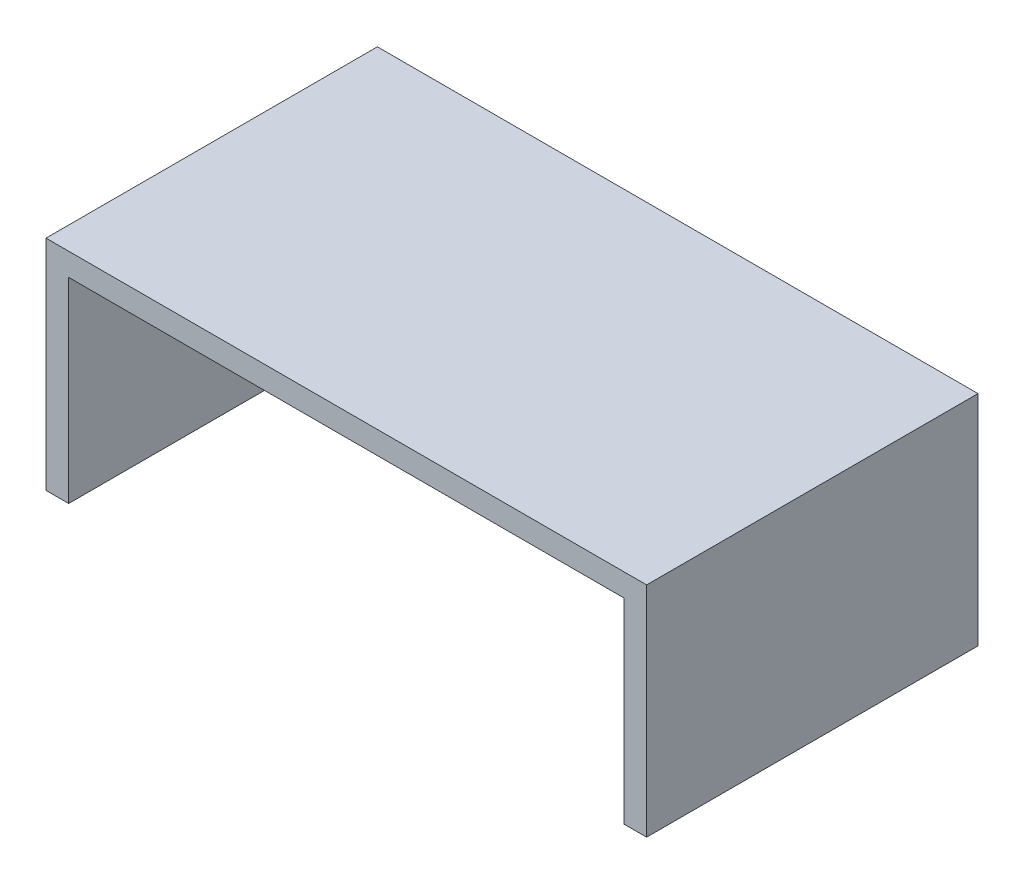
ISO-10303-21;
HEADER;
FILE_DESCRIPTION(('STEP AP214'),'2;1');
FILE_NAME('part.step','',(''),(''),'','','');
FILE_SCHEMA(('AUTOMOTIVE_DESIGN { 1 0 10303 214 1 1 1 1 }'));
ENDSEC;
DATA;
#1=APPLICATION_CONTEXT('core data for automotive mechanical design processes');
#2=APPLICATION_PROTOCOL_DEFINITION('international standard','automotive_design',2000,#1);
#3=PRODUCT_CONTEXT('',#1,'mechanical');
#4=PRODUCT('Part','Part','',(#3));
#5=PRODUCT_RELATED_PRODUCT_CATEGORY('part','',(#4));
#6=PRODUCT_DEFINITION_FORMATION('','',#4);
#7=PRODUCT_DEFINITION_CONTEXT('part definition',#1,'design');
#8=PRODUCT_DEFINITION('design','',#6,#7);
#9=PRODUCT_DEFINITION_SHAPE('','',#8);
#10=(LENGTH_UNIT() NAMED_UNIT(*) SI_UNIT(.MILLI.,.METRE.));
#11=(NAMED_UNIT(*) PLANE_ANGLE_UNIT() SI_UNIT($,.RADIAN.));
#12=(NAMED_UNIT(*) SI_UNIT($,.STERADIAN.) SOLID_ANGLE_UNIT());
#13=UNCERTAINTY_MEASURE_WITH_UNIT(LENGTH_MEASURE(1.E-05),#10,'distance_accuracy_value','');
#14=(GEOMETRIC_REPRESENTATION_CONTEXT(3) GLOBAL_UNCERTAINTY_ASSIGNED_CONTEXT((#13)) GLOBAL_UNIT_ASSIGNED_CONTEXT((#10,
#11,#12)) REPRESENTATION_CONTEXT('',''));
#15=CARTESIAN_POINT('',(0.,0.,0.));
#16=DIRECTION('',(0.,0.,1.));
#17=DIRECTION('',(1.,0.,0.));
#18=AXIS2_PLACEMENT_3D('',#15,#16,#17);
#19=CARTESIAN_POINT('',(-66.25,48.2,-36.55));
#20=DIRECTION('',(1.,0.,0.));
#21=DIRECTION('',(0.,0.,-1.));
#22=AXIS2_PLACEMENT_3D('',#19,#20,#21);
#23=PLANE('',#22);
#24=DIRECTION('',(0.,0.,-1.));
#25=VECTOR('',#24,1.);
#26=CARTESIAN_POINT('',(-66.25,43.2,-10.));
#27=LINE('',#26,#25);
#28=CARTESIAN_POINT('',(-66.25,43.2,9.99999999999999));
#29=VERTEX_POINT('',#28);
#30=CARTESIAN_POINT('',(-66.25,43.2,-10.));
#31=VERTEX_POINT('',#30);
#32=EDGE_CURVE('E212',#29,#31,#27,.T.);
#33=ORIENTED_EDGE('',*,*,#32,.F.);
#34=DIRECTION('',(0.,1.,0.));
#35=VECTOR('',#34,1.);
#36=CARTESIAN_POINT('',(-66.25,43.2,10.));
#37=LINE('',#36,#35);
#38=CARTESIAN_POINT('',(-66.25,33.2,10.));
#39=VERTEX_POINT('',#38);
#40=EDGE_CURVE('E47',#39,#29,#37,.T.);
#41=ORIENTED_EDGE('',*,*,#40,.F.);
#42=DIRECTION('',(0.,0.,1.));
#43=VECTOR('',#42,1.);
#44=CARTESIAN_POINT('',(-66.25,33.2,-10.));
#45=LINE('',#44,#43);
#46=CARTESIAN_POINT('',(-66.25,33.2,-10.));
#47=VERTEX_POINT('',#46);
#48=EDGE_CURVE('E136',#47,#39,#45,.T.);
#49=ORIENTED_EDGE('',*,*,#48,.F.);
#50=DIRECTION('',(0.,-1.,0.));
#51=VECTOR('',#50,1.);
#52=CARTESIAN_POINT('',(-66.25,43.2,-10.));
#53=LINE('',#52,#51);
#54=EDGE_CURVE('E215',#31,#47,#53,.T.);
#55=ORIENTED_EDGE('',*,*,#54,.F.);
#56=EDGE_LOOP('',(#33,#41,#49,#55));
#57=FACE_BOUND('',#56,.T.);
#58=DIRECTION('',(0.,0.,1.));
#59=VECTOR('',#58,1.);
#60=CARTESIAN_POINT('',(-66.25,0.,-36.55));
#61=LINE('',#60,#59);
#62=CARTESIAN_POINT('',(-66.25,0.,-36.55));
#63=VERTEX_POINT('',#62);
#64=CARTESIAN_POINT('',(-66.25,0.,36.55));
#65=VERTEX_POINT('',#64);
#66=EDGE_CURVE('E146',#63,#65,#61,.T.);
#67=ORIENTED_EDGE('',*,*,#66,.T.);
#68=DIRECTION('',(0.,-1.,0.));
#69=VECTOR('',#68,1.);
#70=CARTESIAN_POINT('',(-66.25,48.2,36.55));
#71=LINE('',#70,#69);
#72=CARTESIAN_POINT('',(-66.25,48.2,36.55));
#73=VERTEX_POINT('',#72);
#74=EDGE_CURVE('E11',#73,#65,#71,.T.);
#75=ORIENTED_EDGE('',*,*,#74,.F.);
#76=DIRECTION('',(0.,0.,1.));
#77=VECTOR('',#76,1.);
#78=CARTESIAN_POINT('',(-66.25,48.2,-36.55));
#79=LINE('',#78,#77);
#80=CARTESIAN_POINT('',(-66.25,48.2,-36.55));
#81=VERTEX_POINT('',#80);
#82=EDGE_CURVE('E157',#81,#73,#79,.T.);
#83=ORIENTED_EDGE('',*,*,#82,.F.);
#84=DIRECTION('',(0.,-1.,0.));
#85=VECTOR('',#84,1.);
#86=CARTESIAN_POINT('',(-66.25,48.2,-36.55));
#87=LINE('',#86,#85);
#88=EDGE_CURVE('E169',#81,#63,#87,.T.);
#89=ORIENTED_EDGE('',*,*,#88,.T.);
#90=EDGE_LOOP('',(#67,#75,#83,#89));
#91=FACE_BOUND('',#90,.T.);
#92=ADVANCED_FACE('F33',(#57,#91),#23,.F.);
#93=CARTESIAN_POINT('',(-66.25,48.2,36.55));
#94=DIRECTION('',(0.,0.,-1.));
#95=DIRECTION('',(-1.,0.,0.));
#96=AXIS2_PLACEMENT_3D('',#93,#94,#95);
#97=PLANE('',#96);
#98=DIRECTION('',(1.,0.,0.));
#99=VECTOR('',#98,1.);
#100=CARTESIAN_POINT('',(-66.25,0.,36.55));
#101=LINE('',#100,#99);
#102=CARTESIAN_POINT('',(-61.25,0.,36.55));
#103=VERTEX_POINT('',#102);
#104=EDGE_CURVE('E173',#65,#103,#101,.T.);
#105=ORIENTED_EDGE('',*,*,#104,.T.);
#106=DIRECTION('',(0.,-1.,0.));
#107=VECTOR('',#106,1.);
#108=CARTESIAN_POINT('',(-61.25,0.,36.55));
#109=LINE('',#108,#107);
#110=CARTESIAN_POINT('',(-61.25,43.2,36.55));
#111=VERTEX_POINT('',#110);
#112=EDGE_CURVE('E225',#111,#103,#109,.T.);
#113=ORIENTED_EDGE('',*,*,#112,.F.);
#114=DIRECTION('',(-1.,0.,0.));
#115=VECTOR('',#114,1.);
#116=CARTESIAN_POINT('',(-61.25,43.2,36.55));
#117=LINE('',#116,#115);
#118=CARTESIAN_POINT('',(61.25,43.2,36.55));
#119=VERTEX_POINT('',#118);
#120=EDGE_CURVE('E140',#119,#111,#117,.T.);
#121=ORIENTED_EDGE('',*,*,#120,.F.);
#122=DIRECTION('',(0.,1.,0.));
#123=VECTOR('',#122,1.);
#124=CARTESIAN_POINT('',(61.25,0.,36.55));
#125=LINE('',#124,#123);
#126=CARTESIAN_POINT('',(61.25,0.,36.55));
#127=VERTEX_POINT('',#126);
#128=EDGE_CURVE('E239',#127,#119,#125,.T.);
#129=ORIENTED_EDGE('',*,*,#128,.F.);
#130=CARTESIAN_POINT('',(66.25,0.,36.55));
#131=VERTEX_POINT('',#130);
#132=EDGE_CURVE('E172',#127,#131,#101,.T.);
#133=ORIENTED_EDGE('',*,*,#132,.T.);
#134=DIRECTION('',(0.,-1.,0.));
#135=VECTOR('',#134,1.);
#136=CARTESIAN_POINT('',(66.25,48.2,36.55));
#137=LINE('',#136,#135);
#138=CARTESIAN_POINT('',(66.25,48.2,36.55));
#139=VERTEX_POINT('',#138);
#140=EDGE_CURVE('E40',#139,#131,#137,.T.);
#141=ORIENTED_EDGE('',*,*,#140,.F.);
#142=DIRECTION('',(1.,0.,0.));
#143=VECTOR('',#142,1.);
#144=CARTESIAN_POINT('',(-66.25,48.2,36.55));
#145=LINE('',#144,#143);
#146=EDGE_CURVE('E160',#73,#139,#145,.T.);
#147=ORIENTED_EDGE('',*,*,#146,.F.);
#148=ORIENTED_EDGE('',*,*,#74,.T.);
#149=EDGE_LOOP('',(#105,#113,#121,#129,#133,#141,#147,#148));
#150=FACE_BOUND('',#149,.T.);
#151=ADVANCED_FACE('F204',(#150),#97,.F.);
#152=CARTESIAN_POINT('',(66.25,48.2,-36.55));
#153=DIRECTION('',(1.,0.,0.));
#154=DIRECTION('',(0.,0.,-1.));
#155=AXIS2_PLACEMENT_3D('',#152,#153,#154);
#156=PLANE('',#155);
#157=DIRECTION('',(0.,0.,1.));
#158=VECTOR('',#157,1.);
#159=CARTESIAN_POINT('',(66.25,0.,-36.55));
#160=LINE('',#159,#158);
#161=CARTESIAN_POINT('',(66.25,0.,-36.55));
#162=VERTEX_POINT('',#161);
#163=EDGE_CURVE('E176',#162,#131,#160,.T.);
#164=ORIENTED_EDGE('',*,*,#163,.F.);
#165=DIRECTION('',(0.,-1.,0.));
#166=VECTOR('',#165,1.);
#167=CARTESIAN_POINT('',(66.25,48.2,-36.55));
#168=LINE('',#167,#166);
#169=CARTESIAN_POINT('',(66.25,48.2,-36.55));
#170=VERTEX_POINT('',#169);
#171=EDGE_CURVE('E182',#170,#162,#168,.T.);
#172=ORIENTED_EDGE('',*,*,#171,.F.);
#173=DIRECTION('',(0.,0.,1.));
#174=VECTOR('',#173,1.);
#175=CARTESIAN_POINT('',(66.25,48.2,-36.55));
#176=LINE('',#175,#174);
#177=EDGE_CURVE('E163',#170,#139,#176,.T.);
#178=ORIENTED_EDGE('',*,*,#177,.T.);
#179=ORIENTED_EDGE('',*,*,#140,.T.);
#180=EDGE_LOOP('',(#164,#172,#178,#179));
#181=FACE_BOUND('',#180,.T.);
#182=ADVANCED_FACE('F187',(#181),#156,.T.);
#183=CARTESIAN_POINT('',(-66.25,48.2,-36.55));
#184=DIRECTION('',(0.,0.,-1.));
#185=DIRECTION('',(-1.,0.,0.));
#186=AXIS2_PLACEMENT_3D('',#183,#184,#185);
#187=PLANE('',#186);
#188=DIRECTION('',(1.,0.,0.));
#189=VECTOR('',#188,1.);
#190=CARTESIAN_POINT('',(-66.25,0.,-36.55));
#191=LINE('',#190,#189);
#192=EDGE_CURVE('E161',#63,#162,#191,.T.);
#193=ORIENTED_EDGE('',*,*,#192,.F.);
#194=ORIENTED_EDGE('',*,*,#88,.F.);
#195=DIRECTION('',(1.,0.,0.));
#196=VECTOR('',#195,1.);
#197=CARTESIAN_POINT('',(-66.25,48.2,-36.55));
#198=LINE('',#197,#196);
#199=EDGE_CURVE('E166',#81,#170,#198,.T.);
#200=ORIENTED_EDGE('',*,*,#199,.T.);
#201=ORIENTED_EDGE('',*,*,#171,.T.);
#202=EDGE_LOOP('',(#193,#194,#200,#201));
#203=FACE_BOUND('',#202,.T.);
#204=ADVANCED_FACE('F198',(#203),#187,.T.);
#205=CARTESIAN_POINT('',(0.,48.2,0.));
#206=DIRECTION('',(0.,1.,0.));
#207=DIRECTION('',(0.,0.,1.));
#208=AXIS2_PLACEMENT_3D('',#205,#206,#207);
#209=PLANE('',#208);
#210=ORIENTED_EDGE('',*,*,#82,.T.);
#211=ORIENTED_EDGE('',*,*,#146,.T.);
#212=ORIENTED_EDGE('',*,*,#177,.F.);
#213=ORIENTED_EDGE('',*,*,#199,.F.);
#214=EDGE_LOOP('',(#210,#211,#212,#213));
#215=FACE_BOUND('',#214,.T.);
#216=ADVANCED_FACE('F202',(#215),#209,.T.);
#217=CARTESIAN_POINT('',(0.,0.,0.));
#218=DIRECTION('',(0.,1.,0.));
#219=DIRECTION('',(0.,0.,1.));
#220=AXIS2_PLACEMENT_3D('',#217,#218,#219);
#221=PLANE('',#220);
#222=DIRECTION('',(1.,0.,0.));
#223=VECTOR('',#222,1.);
#224=CARTESIAN_POINT('',(-61.25,0.,-31.55));
#225=LINE('',#224,#223);
#226=CARTESIAN_POINT('',(-61.25,0.,-31.55));
#227=VERTEX_POINT('',#226);
#228=CARTESIAN_POINT('',(61.25,0.,-31.55));
#229=VERTEX_POINT('',#228);
#230=EDGE_CURVE('E231',#227,#229,#225,.T.);
#231=ORIENTED_EDGE('',*,*,#230,.F.);
#232=DIRECTION('',(0.,0.,1.));
#233=VECTOR('',#232,1.);
#234=CARTESIAN_POINT('',(-61.25,0.,-31.55));
#235=LINE('',#234,#233);
#236=EDGE_CURVE('E153',#227,#103,#235,.T.);
#237=ORIENTED_EDGE('',*,*,#236,.T.);
#238=ORIENTED_EDGE('',*,*,#104,.F.);
#239=ORIENTED_EDGE('',*,*,#66,.F.);
#240=ORIENTED_EDGE('',*,*,#192,.T.);
#241=ORIENTED_EDGE('',*,*,#163,.T.);
#242=ORIENTED_EDGE('',*,*,#132,.F.);
#243=DIRECTION('',(0.,0.,1.));
#244=VECTOR('',#243,1.);
#245=CARTESIAN_POINT('',(61.25,0.,-31.55));
#246=LINE('',#245,#244);
#247=EDGE_CURVE('E147',#229,#127,#246,.T.);
#248=ORIENTED_EDGE('',*,*,#247,.F.);
#249=EDGE_LOOP('',(#231,#237,#238,#239,#240,#241,#242,#248));
#250=FACE_BOUND('',#249,.T.);
#251=ADVANCED_FACE('F193',(#250),#221,.F.);
#252=CARTESIAN_POINT('',(-61.25,0.,-31.55));
#253=DIRECTION('',(-1.,0.,0.));
#254=DIRECTION('',(0.,0.,1.));
#255=AXIS2_PLACEMENT_3D('',#252,#253,#254);
#256=PLANE('',#255);
#257=DIRECTION('',(0.,0.,1.));
#258=VECTOR('',#257,1.);
#259=CARTESIAN_POINT('',(-61.25,33.2,-10.));
#260=LINE('',#259,#258);
#261=CARTESIAN_POINT('',(-61.25,33.2,-10.));
#262=VERTEX_POINT('',#261);
#263=CARTESIAN_POINT('',(-61.25,33.2,10.));
#264=VERTEX_POINT('',#263);
#265=EDGE_CURVE('E129',#262,#264,#260,.T.);
#266=ORIENTED_EDGE('',*,*,#265,.T.);
#267=DIRECTION('',(0.,1.,0.));
#268=VECTOR('',#267,1.);
#269=CARTESIAN_POINT('',(-61.25,43.2,10.));
#270=LINE('',#269,#268);
#271=CARTESIAN_POINT('',(-61.25,43.2,10.));
#272=VERTEX_POINT('',#271);
#273=EDGE_CURVE('E122',#264,#272,#270,.T.);
#274=ORIENTED_EDGE('',*,*,#273,.T.);
#275=DIRECTION('',(0.,0.,1.));
#276=VECTOR('',#275,1.);
#277=CARTESIAN_POINT('',(-61.25,43.2,-31.55));
#278=LINE('',#277,#276);
#279=EDGE_CURVE('E133',#272,#111,#278,.T.);
#280=ORIENTED_EDGE('',*,*,#279,.T.);
#281=ORIENTED_EDGE('',*,*,#112,.T.);
#282=ORIENTED_EDGE('',*,*,#236,.F.);
#283=DIRECTION('',(0.,-1.,0.));
#284=VECTOR('',#283,1.);
#285=CARTESIAN_POINT('',(-61.25,0.,-31.55));
#286=LINE('',#285,#284);
#287=CARTESIAN_POINT('',(-61.25,43.2,-31.55));
#288=VERTEX_POINT('',#287);
#289=EDGE_CURVE('E229',#288,#227,#286,.T.);
#290=ORIENTED_EDGE('',*,*,#289,.F.);
#291=CARTESIAN_POINT('',(-61.25,43.2,-10.));
#292=VERTEX_POINT('',#291);
#293=EDGE_CURVE('E142',#288,#292,#278,.T.);
#294=ORIENTED_EDGE('',*,*,#293,.T.);
#295=DIRECTION('',(0.,-1.,0.));
#296=VECTOR('',#295,1.);
#297=CARTESIAN_POINT('',(-61.25,43.2,-10.));
#298=LINE('',#297,#296);
#299=EDGE_CURVE('E55',#292,#262,#298,.T.);
#300=ORIENTED_EDGE('',*,*,#299,.T.);
#301=EDGE_LOOP('',(#266,#274,#280,#281,#282,#290,#294,#300));
#302=FACE_BOUND('',#301,.T.);
#303=ADVANCED_FACE('F132',(#302),#256,.F.);
#304=CARTESIAN_POINT('',(-61.25,43.2,-31.55));
#305=DIRECTION('',(0.,1.,0.));
#306=DIRECTION('',(0.,0.,1.));
#307=AXIS2_PLACEMENT_3D('',#304,#305,#306);
#308=PLANE('',#307);
#309=ORIENTED_EDGE('',*,*,#120,.T.);
#310=ORIENTED_EDGE('',*,*,#279,.F.);
#311=DIRECTION('',(-1.,0.,0.));
#312=VECTOR('',#311,1.);
#313=CARTESIAN_POINT('',(-61.25,43.2,10.));
#314=LINE('',#313,#312);
#315=EDGE_CURVE('E119',#272,#29,#314,.T.);
#316=ORIENTED_EDGE('',*,*,#315,.T.);
#317=ORIENTED_EDGE('',*,*,#32,.T.);
#318=DIRECTION('',(-1.,0.,0.));
#319=VECTOR('',#318,1.);
#320=CARTESIAN_POINT('',(-61.25,43.2,-10.));
#321=LINE('',#320,#319);
#322=EDGE_CURVE('E128',#292,#31,#321,.T.);
#323=ORIENTED_EDGE('',*,*,#322,.F.);
#324=ORIENTED_EDGE('',*,*,#293,.F.);
#325=DIRECTION('',(-1.,0.,0.));
#326=VECTOR('',#325,1.);
#327=CARTESIAN_POINT('',(-61.25,43.2,-31.55));
#328=LINE('',#327,#326);
#329=CARTESIAN_POINT('',(61.25,43.2,-31.55));
#330=VERTEX_POINT('',#329);
#331=EDGE_CURVE('E156',#330,#288,#328,.T.);
#332=ORIENTED_EDGE('',*,*,#331,.F.);
#333=DIRECTION('',(0.,0.,1.));
#334=VECTOR('',#333,1.);
#335=CARTESIAN_POINT('',(61.25,43.2,-31.55));
#336=LINE('',#335,#334);
#337=EDGE_CURVE('E143',#330,#119,#336,.T.);
#338=ORIENTED_EDGE('',*,*,#337,.T.);
#339=EDGE_LOOP('',(#309,#310,#316,#317,#323,#324,#332,#338));
#340=FACE_BOUND('',#339,.T.);
#341=ADVANCED_FACE('F138',(#340),#308,.F.);
#342=CARTESIAN_POINT('',(61.25,0.,-31.55));
#343=DIRECTION('',(1.,0.,0.));
#344=DIRECTION('',(0.,1.,0.));
#345=AXIS2_PLACEMENT_3D('',#342,#343,#344);
#346=PLANE('',#345);
#347=ORIENTED_EDGE('',*,*,#128,.T.);
#348=ORIENTED_EDGE('',*,*,#337,.F.);
#349=DIRECTION('',(0.,1.,0.));
#350=VECTOR('',#349,1.);
#351=CARTESIAN_POINT('',(61.25,0.,-31.55));
#352=LINE('',#351,#350);
#353=EDGE_CURVE('E234',#229,#330,#352,.T.);
#354=ORIENTED_EDGE('',*,*,#353,.F.);
#355=ORIENTED_EDGE('',*,*,#247,.T.);
#356=EDGE_LOOP('',(#347,#348,#354,#355));
#357=FACE_BOUND('',#356,.T.);
#358=ADVANCED_FACE('F243',(#357),#346,.F.);
#359=CARTESIAN_POINT('',(0.,0.,-31.55));
#360=DIRECTION('',(0.,0.,-1.));
#361=DIRECTION('',(-1.,0.,0.));
#362=AXIS2_PLACEMENT_3D('',#359,#360,#361);
#363=PLANE('',#362);
#364=ORIENTED_EDGE('',*,*,#289,.T.);
#365=ORIENTED_EDGE('',*,*,#230,.T.);
#366=ORIENTED_EDGE('',*,*,#353,.T.);
#367=ORIENTED_EDGE('',*,*,#331,.T.);
#368=EDGE_LOOP('',(#364,#365,#366,#367));
#369=FACE_BOUND('',#368,.T.);
#370=ADVANCED_FACE('F247',(#369),#363,.F.);
#371=CARTESIAN_POINT('',(-61.25,43.2,10.));
#372=DIRECTION('',(0.,0.,1.));
#373=DIRECTION('',(1.,0.,0.));
#374=AXIS2_PLACEMENT_3D('',#371,#372,#373);
#375=PLANE('',#374);
#376=ORIENTED_EDGE('',*,*,#40,.T.);
#377=ORIENTED_EDGE('',*,*,#315,.F.);
#378=ORIENTED_EDGE('',*,*,#273,.F.);
#379=DIRECTION('',(-1.,0.,0.));
#380=VECTOR('',#379,1.);
#381=CARTESIAN_POINT('',(-61.25,33.2,10.));
#382=LINE('',#381,#380);
#383=EDGE_CURVE('E223',#264,#39,#382,.T.);
#384=ORIENTED_EDGE('',*,*,#383,.T.);
#385=EDGE_LOOP('',(#376,#377,#378,#384));
#386=FACE_BOUND('',#385,.T.);
#387=ADVANCED_FACE('F121',(#386),#375,.F.);
#388=CARTESIAN_POINT('',(-61.25,33.2,-10.));
#389=DIRECTION('',(0.,-1.,0.));
#390=DIRECTION('',(0.,0.,-1.));
#391=AXIS2_PLACEMENT_3D('',#388,#389,#390);
#392=PLANE('',#391);
#393=ORIENTED_EDGE('',*,*,#48,.T.);
#394=ORIENTED_EDGE('',*,*,#383,.F.);
#395=ORIENTED_EDGE('',*,*,#265,.F.);
#396=DIRECTION('',(-1.,0.,0.));
#397=VECTOR('',#396,1.);
#398=CARTESIAN_POINT('',(-61.25,33.2,-10.));
#399=LINE('',#398,#397);
#400=EDGE_CURVE('E226',#262,#47,#399,.T.);
#401=ORIENTED_EDGE('',*,*,#400,.T.);
#402=EDGE_LOOP('',(#393,#394,#395,#401));
#403=FACE_BOUND('',#402,.T.);
#404=ADVANCED_FACE('F251',(#403),#392,.F.);
#405=CARTESIAN_POINT('',(-61.25,43.2,-10.));
#406=DIRECTION('',(0.,0.,-1.));
#407=DIRECTION('',(-1.,0.,0.));
#408=AXIS2_PLACEMENT_3D('',#405,#406,#407);
#409=PLANE('',#408);
#410=ORIENTED_EDGE('',*,*,#54,.T.);
#411=ORIENTED_EDGE('',*,*,#400,.F.);
#412=ORIENTED_EDGE('',*,*,#299,.F.);
#413=ORIENTED_EDGE('',*,*,#322,.T.);
#414=EDGE_LOOP('',(#410,#411,#412,#413));
#415=FACE_BOUND('',#414,.T.);
#416=ADVANCED_FACE('F249',(#415),#409,.F.);
#417=CLOSED_SHELL('',(#92,#151,#182,#204,#216,#251,#303,#341,#358,#370,#387,#404,#416));
#418=MANIFOLD_SOLID_BREP('B2',#417);
#419=ADVANCED_BREP_SHAPE_REPRESENTATION('',(#18,#418),#14);
#420=SHAPE_DEFINITION_REPRESENTATION(#9,#419);
ENDSEC;
END-ISO-10303-21;
